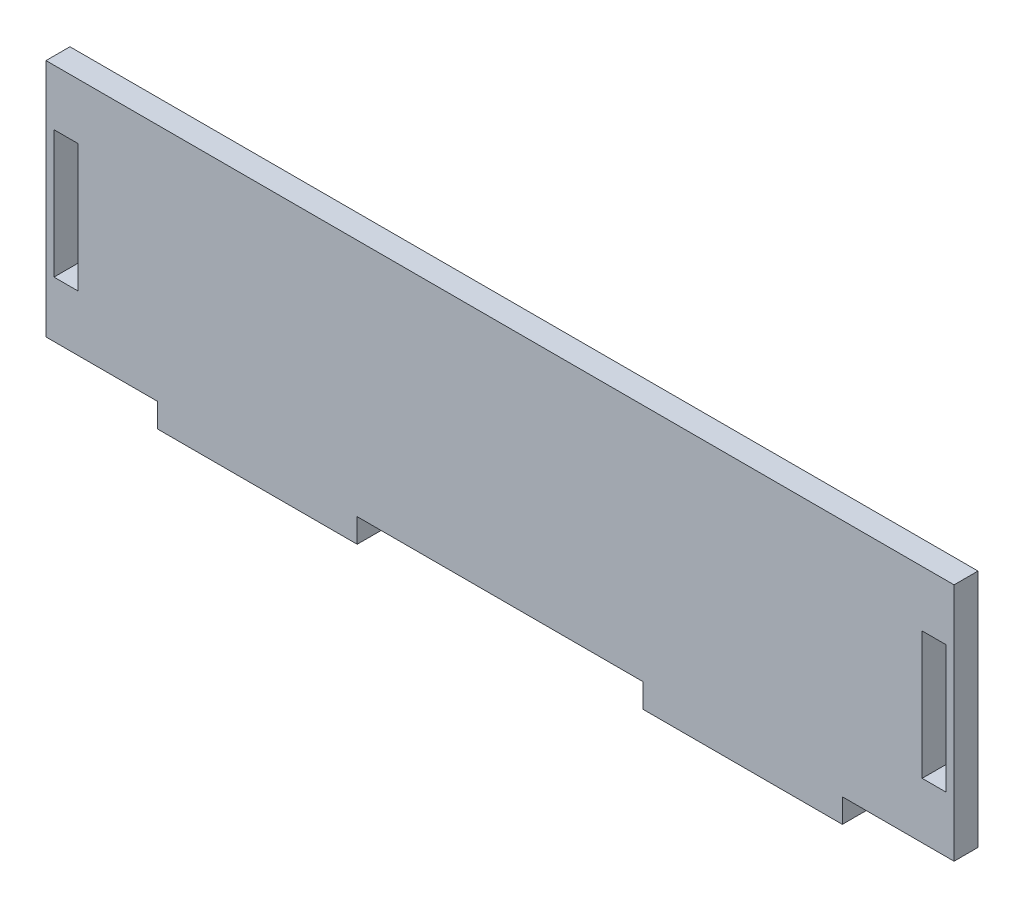
ISO-10303-21;
HEADER;
FILE_DESCRIPTION(('STEP AP214'),'2;1');
FILE_NAME('part.step','',(''),(''),'','','');
FILE_SCHEMA(('AUTOMOTIVE_DESIGN { 1 0 10303 214 1 1 1 1 }'));
ENDSEC;
DATA;
#1=APPLICATION_CONTEXT('core data for automotive mechanical design processes');
#2=APPLICATION_PROTOCOL_DEFINITION('international standard','automotive_design',2000,#1);
#3=PRODUCT_CONTEXT('',#1,'mechanical');
#4=PRODUCT('Part','Part','',(#3));
#5=PRODUCT_RELATED_PRODUCT_CATEGORY('part','',(#4));
#6=PRODUCT_DEFINITION_FORMATION('','',#4);
#7=PRODUCT_DEFINITION_CONTEXT('part definition',#1,'design');
#8=PRODUCT_DEFINITION('design','',#6,#7);
#9=PRODUCT_DEFINITION_SHAPE('','',#8);
#10=(LENGTH_UNIT() NAMED_UNIT(*) SI_UNIT(.MILLI.,.METRE.));
#11=(NAMED_UNIT(*) PLANE_ANGLE_UNIT() SI_UNIT($,.RADIAN.));
#12=(NAMED_UNIT(*) SI_UNIT($,.STERADIAN.) SOLID_ANGLE_UNIT());
#13=UNCERTAINTY_MEASURE_WITH_UNIT(LENGTH_MEASURE(1.E-05),#10,'distance_accuracy_value','');
#14=(GEOMETRIC_REPRESENTATION_CONTEXT(3) GLOBAL_UNCERTAINTY_ASSIGNED_CONTEXT((#13)) GLOBAL_UNIT_ASSIGNED_CONTEXT((#10,
#11,#12)) REPRESENTATION_CONTEXT('',''));
#15=CARTESIAN_POINT('',(0.,0.,0.));
#16=DIRECTION('',(0.,0.,1.));
#17=DIRECTION('',(1.,0.,0.));
#18=AXIS2_PLACEMENT_3D('',#15,#16,#17);
#19=CARTESIAN_POINT('',(0.,23.,3.));
#20=DIRECTION('',(0.,-1.,0.));
#21=DIRECTION('',(0.,0.,-1.));
#22=AXIS2_PLACEMENT_3D('',#19,#20,#21);
#23=PLANE('',#22);
#24=DIRECTION('',(-1.,0.,0.));
#25=VECTOR('',#24,1.);
#26=CARTESIAN_POINT('',(0.,23.,0.));
#27=LINE('',#26,#25);
#28=CARTESIAN_POINT('',(6.50000000000001,23.,0.));
#29=VERTEX_POINT('',#28);
#30=CARTESIAN_POINT('',(3.50000000000001,23.,0.));
#31=VERTEX_POINT('',#30);
#32=EDGE_CURVE('E253',#29,#31,#27,.T.);
#33=ORIENTED_EDGE('',*,*,#32,.F.);
#34=DIRECTION('',(0.,0.,-1.));
#35=VECTOR('',#34,1.);
#36=CARTESIAN_POINT('',(6.50000000000001,23.,3.));
#37=LINE('',#36,#35);
#38=CARTESIAN_POINT('',(6.50000000000001,23.,3.));
#39=VERTEX_POINT('',#38);
#40=EDGE_CURVE('E11',#39,#29,#37,.T.);
#41=ORIENTED_EDGE('',*,*,#40,.F.);
#42=DIRECTION('',(-1.,0.,0.));
#43=VECTOR('',#42,1.);
#44=CARTESIAN_POINT('',(0.,23.,3.));
#45=LINE('',#44,#43);
#46=CARTESIAN_POINT('',(3.50000000000001,23.,3.));
#47=VERTEX_POINT('',#46);
#48=EDGE_CURVE('E201',#39,#47,#45,.T.);
#49=ORIENTED_EDGE('',*,*,#48,.T.);
#50=DIRECTION('',(0.,0.,-1.));
#51=VECTOR('',#50,1.);
#52=CARTESIAN_POINT('',(3.50000000000001,23.,3.));
#53=LINE('',#52,#51);
#54=EDGE_CURVE('E127',#47,#31,#53,.T.);
#55=ORIENTED_EDGE('',*,*,#54,.T.);
#56=EDGE_LOOP('',(#33,#41,#49,#55));
#57=FACE_BOUND('',#56,.T.);
#58=ADVANCED_FACE('F37',(#57),#23,.T.);
#59=CARTESIAN_POINT('',(6.50000000000001,0.,3.));
#60=DIRECTION('',(-1.,0.,0.));
#61=DIRECTION('',(0.,0.,1.));
#62=AXIS2_PLACEMENT_3D('',#59,#60,#61);
#63=PLANE('',#62);
#64=DIRECTION('',(0.,1.,0.));
#65=VECTOR('',#64,1.);
#66=CARTESIAN_POINT('',(6.50000000000001,0.,0.));
#67=LINE('',#66,#65);
#68=CARTESIAN_POINT('',(6.50000000000001,7.,0.));
#69=VERTEX_POINT('',#68);
#70=EDGE_CURVE('E191',#69,#29,#67,.T.);
#71=ORIENTED_EDGE('',*,*,#70,.F.);
#72=DIRECTION('',(0.,0.,-1.));
#73=VECTOR('',#72,1.);
#74=CARTESIAN_POINT('',(6.50000000000001,7.,3.));
#75=LINE('',#74,#73);
#76=CARTESIAN_POINT('',(6.50000000000001,7.,3.));
#77=VERTEX_POINT('',#76);
#78=EDGE_CURVE('E47',#77,#69,#75,.T.);
#79=ORIENTED_EDGE('',*,*,#78,.F.);
#80=DIRECTION('',(0.,1.,0.));
#81=VECTOR('',#80,1.);
#82=CARTESIAN_POINT('',(6.50000000000001,0.,3.));
#83=LINE('',#82,#81);
#84=EDGE_CURVE('E189',#77,#39,#83,.T.);
#85=ORIENTED_EDGE('',*,*,#84,.T.);
#86=ORIENTED_EDGE('',*,*,#40,.T.);
#87=EDGE_LOOP('',(#71,#79,#85,#86));
#88=FACE_BOUND('',#87,.T.);
#89=ADVANCED_FACE('F187',(#88),#63,.T.);
#90=CARTESIAN_POINT('',(0.,7.,3.));
#91=DIRECTION('',(0.,-1.,0.));
#92=DIRECTION('',(0.,0.,-1.));
#93=AXIS2_PLACEMENT_3D('',#90,#91,#92);
#94=PLANE('',#93);
#95=DIRECTION('',(-1.,0.,0.));
#96=VECTOR('',#95,1.);
#97=CARTESIAN_POINT('',(0.,7.,0.));
#98=LINE('',#97,#96);
#99=CARTESIAN_POINT('',(3.50000000000001,7.,0.));
#100=VERTEX_POINT('',#99);
#101=EDGE_CURVE('E256',#69,#100,#98,.T.);
#102=ORIENTED_EDGE('',*,*,#101,.T.);
#103=DIRECTION('',(0.,0.,-1.));
#104=VECTOR('',#103,1.);
#105=CARTESIAN_POINT('',(3.50000000000001,7.,3.));
#106=LINE('',#105,#104);
#107=CARTESIAN_POINT('',(3.50000000000001,7.,3.));
#108=VERTEX_POINT('',#107);
#109=EDGE_CURVE('E194',#108,#100,#106,.T.);
#110=ORIENTED_EDGE('',*,*,#109,.F.);
#111=DIRECTION('',(-1.,0.,0.));
#112=VECTOR('',#111,1.);
#113=CARTESIAN_POINT('',(0.,7.,3.));
#114=LINE('',#113,#112);
#115=EDGE_CURVE('E197',#77,#108,#114,.T.);
#116=ORIENTED_EDGE('',*,*,#115,.F.);
#117=ORIENTED_EDGE('',*,*,#78,.T.);
#118=EDGE_LOOP('',(#102,#110,#116,#117));
#119=FACE_BOUND('',#118,.T.);
#120=ADVANCED_FACE('F198',(#119),#94,.F.);
#121=CARTESIAN_POINT('',(112.3,0.,3.));
#122=DIRECTION('',(-1.,0.,0.));
#123=DIRECTION('',(0.,0.,1.));
#124=AXIS2_PLACEMENT_3D('',#121,#122,#123);
#125=PLANE('',#124);
#126=DIRECTION('',(0.,1.,0.));
#127=VECTOR('',#126,1.);
#128=CARTESIAN_POINT('',(112.3,0.,0.));
#129=LINE('',#128,#127);
#130=CARTESIAN_POINT('',(112.3,7.,0.));
#131=VERTEX_POINT('',#130);
#132=CARTESIAN_POINT('',(112.3,23.,0.));
#133=VERTEX_POINT('',#132);
#134=EDGE_CURVE('E242',#131,#133,#129,.T.);
#135=ORIENTED_EDGE('',*,*,#134,.T.);
#136=DIRECTION('',(0.,0.,-1.));
#137=VECTOR('',#136,1.);
#138=CARTESIAN_POINT('',(112.3,23.,3.));
#139=LINE('',#138,#137);
#140=CARTESIAN_POINT('',(112.3,23.,3.));
#141=VERTEX_POINT('',#140);
#142=EDGE_CURVE('E261',#141,#133,#139,.T.);
#143=ORIENTED_EDGE('',*,*,#142,.F.);
#144=DIRECTION('',(0.,1.,0.));
#145=VECTOR('',#144,1.);
#146=CARTESIAN_POINT('',(112.3,0.,3.));
#147=LINE('',#146,#145);
#148=CARTESIAN_POINT('',(112.3,7.,3.));
#149=VERTEX_POINT('',#148);
#150=EDGE_CURVE('E376',#149,#141,#147,.T.);
#151=ORIENTED_EDGE('',*,*,#150,.F.);
#152=DIRECTION('',(0.,0.,-1.));
#153=VECTOR('',#152,1.);
#154=CARTESIAN_POINT('',(112.3,7.,3.));
#155=LINE('',#154,#153);
#156=EDGE_CURVE('E263',#149,#131,#155,.T.);
#157=ORIENTED_EDGE('',*,*,#156,.T.);
#158=EDGE_LOOP('',(#135,#143,#151,#157));
#159=FACE_BOUND('',#158,.T.);
#160=ADVANCED_FACE('F398',(#159),#125,.F.);
#161=CARTESIAN_POINT('',(0.,23.,3.));
#162=DIRECTION('',(0.,1.,0.));
#163=DIRECTION('',(0.,0.,1.));
#164=AXIS2_PLACEMENT_3D('',#161,#162,#163);
#165=PLANE('',#164);
#166=DIRECTION('',(1.,0.,0.));
#167=VECTOR('',#166,1.);
#168=CARTESIAN_POINT('',(0.,23.,0.));
#169=LINE('',#168,#167);
#170=CARTESIAN_POINT('',(115.3,23.,0.));
#171=VERTEX_POINT('',#170);
#172=EDGE_CURVE('E245',#133,#171,#169,.T.);
#173=ORIENTED_EDGE('',*,*,#172,.T.);
#174=DIRECTION('',(0.,0.,-1.));
#175=VECTOR('',#174,1.);
#176=CARTESIAN_POINT('',(115.3,23.,3.));
#177=LINE('',#176,#175);
#178=CARTESIAN_POINT('',(115.3,23.,3.));
#179=VERTEX_POINT('',#178);
#180=EDGE_CURVE('E267',#179,#171,#177,.T.);
#181=ORIENTED_EDGE('',*,*,#180,.F.);
#182=DIRECTION('',(1.,0.,0.));
#183=VECTOR('',#182,1.);
#184=CARTESIAN_POINT('',(0.,23.,3.));
#185=LINE('',#184,#183);
#186=EDGE_CURVE('E379',#141,#179,#185,.T.);
#187=ORIENTED_EDGE('',*,*,#186,.F.);
#188=ORIENTED_EDGE('',*,*,#142,.T.);
#189=EDGE_LOOP('',(#173,#181,#187,#188));
#190=FACE_BOUND('',#189,.T.);
#191=ADVANCED_FACE('F400',(#190),#165,.F.);
#192=CARTESIAN_POINT('',(115.3,0.,3.));
#193=DIRECTION('',(1.,0.,0.));
#194=DIRECTION('',(0.,0.,-1.));
#195=AXIS2_PLACEMENT_3D('',#192,#193,#194);
#196=PLANE('',#195);
#197=DIRECTION('',(0.,-1.,0.));
#198=VECTOR('',#197,1.);
#199=CARTESIAN_POINT('',(115.3,0.,0.));
#200=LINE('',#199,#198);
#201=CARTESIAN_POINT('',(115.3,7.,0.));
#202=VERTEX_POINT('',#201);
#203=EDGE_CURVE('E247',#171,#202,#200,.T.);
#204=ORIENTED_EDGE('',*,*,#203,.T.);
#205=DIRECTION('',(0.,0.,-1.));
#206=VECTOR('',#205,1.);
#207=CARTESIAN_POINT('',(115.3,7.,3.));
#208=LINE('',#207,#206);
#209=CARTESIAN_POINT('',(115.3,7.,3.));
#210=VERTEX_POINT('',#209);
#211=EDGE_CURVE('E265',#210,#202,#208,.T.);
#212=ORIENTED_EDGE('',*,*,#211,.F.);
#213=DIRECTION('',(0.,-1.,0.));
#214=VECTOR('',#213,1.);
#215=CARTESIAN_POINT('',(115.3,0.,3.));
#216=LINE('',#215,#214);
#217=EDGE_CURVE('E381',#179,#210,#216,.T.);
#218=ORIENTED_EDGE('',*,*,#217,.F.);
#219=ORIENTED_EDGE('',*,*,#180,.T.);
#220=EDGE_LOOP('',(#204,#212,#218,#219));
#221=FACE_BOUND('',#220,.T.);
#222=ADVANCED_FACE('F394',(#221),#196,.F.);
#223=CARTESIAN_POINT('',(0.,30.,3.));
#224=DIRECTION('',(0.,1.,0.));
#225=DIRECTION('',(0.,0.,1.));
#226=AXIS2_PLACEMENT_3D('',#223,#224,#225);
#227=PLANE('',#226);
#228=DIRECTION('',(1.,0.,0.));
#229=VECTOR('',#228,1.);
#230=CARTESIAN_POINT('',(0.,30.,0.));
#231=LINE('',#230,#229);
#232=CARTESIAN_POINT('',(2.50000000000001,30.,0.));
#233=VERTEX_POINT('',#232);
#234=CARTESIAN_POINT('',(116.3,30.,0.));
#235=VERTEX_POINT('',#234);
#236=EDGE_CURVE('E209',#233,#235,#231,.T.);
#237=ORIENTED_EDGE('',*,*,#236,.F.);
#238=DIRECTION('',(0.,0.,-1.));
#239=VECTOR('',#238,1.);
#240=CARTESIAN_POINT('',(2.50000000000001,30.,3.));
#241=LINE('',#240,#239);
#242=CARTESIAN_POINT('',(2.50000000000001,30.,3.));
#243=VERTEX_POINT('',#242);
#244=EDGE_CURVE('E41',#243,#233,#241,.T.);
#245=ORIENTED_EDGE('',*,*,#244,.F.);
#246=DIRECTION('',(1.,0.,0.));
#247=VECTOR('',#246,1.);
#248=CARTESIAN_POINT('',(0.,30.,3.));
#249=LINE('',#248,#247);
#250=CARTESIAN_POINT('',(116.3,30.,3.));
#251=VERTEX_POINT('',#250);
#252=EDGE_CURVE('E259',#243,#251,#249,.T.);
#253=ORIENTED_EDGE('',*,*,#252,.T.);
#254=DIRECTION('',(0.,0.,-1.));
#255=VECTOR('',#254,1.);
#256=CARTESIAN_POINT('',(116.3,30.,3.));
#257=LINE('',#256,#255);
#258=EDGE_CURVE('E208',#251,#235,#257,.T.);
#259=ORIENTED_EDGE('',*,*,#258,.T.);
#260=EDGE_LOOP('',(#237,#245,#253,#259));
#261=FACE_BOUND('',#260,.T.);
#262=ADVANCED_FACE('F39',(#261),#227,.T.);
#263=CARTESIAN_POINT('',(2.50000000000001,0.,3.));
#264=DIRECTION('',(1.,0.,0.));
#265=DIRECTION('',(0.,0.,-1.));
#266=AXIS2_PLACEMENT_3D('',#263,#264,#265);
#267=PLANE('',#266);
#268=DIRECTION('',(0.,-1.,0.));
#269=VECTOR('',#268,1.);
#270=CARTESIAN_POINT('',(2.50000000000001,0.,0.));
#271=LINE('',#270,#269);
#272=CARTESIAN_POINT('',(2.50000000000001,0.,0.));
#273=VERTEX_POINT('',#272);
#274=EDGE_CURVE('E212',#233,#273,#271,.T.);
#275=ORIENTED_EDGE('',*,*,#274,.T.);
#276=DIRECTION('',(0.,0.,-1.));
#277=VECTOR('',#276,1.);
#278=CARTESIAN_POINT('',(2.50000000000001,0.,3.));
#279=LINE('',#278,#277);
#280=CARTESIAN_POINT('',(2.50000000000001,0.,3.));
#281=VERTEX_POINT('',#280);
#282=EDGE_CURVE('E292',#281,#273,#279,.T.);
#283=ORIENTED_EDGE('',*,*,#282,.F.);
#284=DIRECTION('',(0.,-1.,0.));
#285=VECTOR('',#284,1.);
#286=CARTESIAN_POINT('',(2.50000000000001,0.,3.));
#287=LINE('',#286,#285);
#288=EDGE_CURVE('E301',#243,#281,#287,.T.);
#289=ORIENTED_EDGE('',*,*,#288,.F.);
#290=ORIENTED_EDGE('',*,*,#244,.T.);
#291=EDGE_LOOP('',(#275,#283,#289,#290));
#292=FACE_BOUND('',#291,.T.);
#293=ADVANCED_FACE('F300',(#292),#267,.F.);
#294=CARTESIAN_POINT('',(0.,0.,3.));
#295=DIRECTION('',(0.,1.,0.));
#296=DIRECTION('',(0.,0.,1.));
#297=AXIS2_PLACEMENT_3D('',#294,#295,#296);
#298=PLANE('',#297);
#299=DIRECTION('',(1.,0.,0.));
#300=VECTOR('',#299,1.);
#301=CARTESIAN_POINT('',(0.,0.,0.));
#302=LINE('',#301,#300);
#303=CARTESIAN_POINT('',(16.5,0.,0.));
#304=VERTEX_POINT('',#303);
#305=EDGE_CURVE('E214',#273,#304,#302,.T.);
#306=ORIENTED_EDGE('',*,*,#305,.T.);
#307=DIRECTION('',(0.,0.,-1.));
#308=VECTOR('',#307,1.);
#309=CARTESIAN_POINT('',(16.5,0.,3.));
#310=LINE('',#309,#308);
#311=CARTESIAN_POINT('',(16.5,0.,3.));
#312=VERTEX_POINT('',#311);
#313=EDGE_CURVE('E290',#312,#304,#310,.T.);
#314=ORIENTED_EDGE('',*,*,#313,.F.);
#315=DIRECTION('',(1.,0.,0.));
#316=VECTOR('',#315,1.);
#317=CARTESIAN_POINT('',(0.,0.,3.));
#318=LINE('',#317,#316);
#319=EDGE_CURVE('E358',#281,#312,#318,.T.);
#320=ORIENTED_EDGE('',*,*,#319,.F.);
#321=ORIENTED_EDGE('',*,*,#282,.T.);
#322=EDGE_LOOP('',(#306,#314,#320,#321));
#323=FACE_BOUND('',#322,.T.);
#324=ADVANCED_FACE('F357',(#323),#298,.F.);
#325=CARTESIAN_POINT('',(16.5,0.,3.));
#326=DIRECTION('',(1.,0.,0.));
#327=DIRECTION('',(0.,0.,-1.));
#328=AXIS2_PLACEMENT_3D('',#325,#326,#327);
#329=PLANE('',#328);
#330=DIRECTION('',(0.,-1.,0.));
#331=VECTOR('',#330,1.);
#332=CARTESIAN_POINT('',(16.5,0.,0.));
#333=LINE('',#332,#331);
#334=CARTESIAN_POINT('',(16.5,-3.,0.));
#335=VERTEX_POINT('',#334);
#336=EDGE_CURVE('E216',#304,#335,#333,.T.);
#337=ORIENTED_EDGE('',*,*,#336,.T.);
#338=DIRECTION('',(0.,0.,-1.));
#339=VECTOR('',#338,1.);
#340=CARTESIAN_POINT('',(16.5,-3.,3.));
#341=LINE('',#340,#339);
#342=CARTESIAN_POINT('',(16.5,-3.,3.));
#343=VERTEX_POINT('',#342);
#344=EDGE_CURVE('E288',#343,#335,#341,.T.);
#345=ORIENTED_EDGE('',*,*,#344,.F.);
#346=DIRECTION('',(0.,-1.,0.));
#347=VECTOR('',#346,1.);
#348=CARTESIAN_POINT('',(16.5,0.,3.));
#349=LINE('',#348,#347);
#350=EDGE_CURVE('E356',#312,#343,#349,.T.);
#351=ORIENTED_EDGE('',*,*,#350,.F.);
#352=ORIENTED_EDGE('',*,*,#313,.T.);
#353=EDGE_LOOP('',(#337,#345,#351,#352));
#354=FACE_BOUND('',#353,.T.);
#355=ADVANCED_FACE('F354',(#354),#329,.F.);
#356=CARTESIAN_POINT('',(0.,-3.,3.));
#357=DIRECTION('',(0.,-1.,0.));
#358=DIRECTION('',(0.,0.,-1.));
#359=AXIS2_PLACEMENT_3D('',#356,#357,#358);
#360=PLANE('',#359);
#361=DIRECTION('',(-1.,0.,0.));
#362=VECTOR('',#361,1.);
#363=CARTESIAN_POINT('',(0.,-3.,0.));
#364=LINE('',#363,#362);
#365=CARTESIAN_POINT('',(41.5,-3.,0.));
#366=VERTEX_POINT('',#365);
#367=EDGE_CURVE('E219',#366,#335,#364,.T.);
#368=ORIENTED_EDGE('',*,*,#367,.F.);
#369=DIRECTION('',(0.,0.,-1.));
#370=VECTOR('',#369,1.);
#371=CARTESIAN_POINT('',(41.5,-3.,3.));
#372=LINE('',#371,#370);
#373=CARTESIAN_POINT('',(41.5,-3.,3.));
#374=VERTEX_POINT('',#373);
#375=EDGE_CURVE('E286',#374,#366,#372,.T.);
#376=ORIENTED_EDGE('',*,*,#375,.F.);
#377=DIRECTION('',(-1.,0.,0.));
#378=VECTOR('',#377,1.);
#379=CARTESIAN_POINT('',(0.,-3.,3.));
#380=LINE('',#379,#378);
#381=EDGE_CURVE('E351',#374,#343,#380,.T.);
#382=ORIENTED_EDGE('',*,*,#381,.T.);
#383=ORIENTED_EDGE('',*,*,#344,.T.);
#384=EDGE_LOOP('',(#368,#376,#382,#383));
#385=FACE_BOUND('',#384,.T.);
#386=ADVANCED_FACE('F347',(#385),#360,.T.);
#387=CARTESIAN_POINT('',(41.5,0.,3.));
#388=DIRECTION('',(1.,0.,0.));
#389=DIRECTION('',(0.,0.,-1.));
#390=AXIS2_PLACEMENT_3D('',#387,#388,#389);
#391=PLANE('',#390);
#392=DIRECTION('',(0.,-1.,0.));
#393=VECTOR('',#392,1.);
#394=CARTESIAN_POINT('',(41.5,0.,0.));
#395=LINE('',#394,#393);
#396=CARTESIAN_POINT('',(41.5,0.,0.));
#397=VERTEX_POINT('',#396);
#398=EDGE_CURVE('E222',#397,#366,#395,.T.);
#399=ORIENTED_EDGE('',*,*,#398,.F.);
#400=DIRECTION('',(0.,0.,-1.));
#401=VECTOR('',#400,1.);
#402=CARTESIAN_POINT('',(41.5,0.,3.));
#403=LINE('',#402,#401);
#404=CARTESIAN_POINT('',(41.5,0.,3.));
#405=VERTEX_POINT('',#404);
#406=EDGE_CURVE('E284',#405,#397,#403,.T.);
#407=ORIENTED_EDGE('',*,*,#406,.F.);
#408=DIRECTION('',(0.,-1.,0.));
#409=VECTOR('',#408,1.);
#410=CARTESIAN_POINT('',(41.5,0.,3.));
#411=LINE('',#410,#409);
#412=EDGE_CURVE('E366',#405,#374,#411,.T.);
#413=ORIENTED_EDGE('',*,*,#412,.T.);
#414=ORIENTED_EDGE('',*,*,#375,.T.);
#415=EDGE_LOOP('',(#399,#407,#413,#414));
#416=FACE_BOUND('',#415,.T.);
#417=ADVANCED_FACE('F344',(#416),#391,.T.);
#418=CARTESIAN_POINT('',(0.,0.,3.));
#419=DIRECTION('',(0.,-1.,0.));
#420=DIRECTION('',(0.,0.,-1.));
#421=AXIS2_PLACEMENT_3D('',#418,#419,#420);
#422=PLANE('',#421);
#423=DIRECTION('',(-1.,0.,0.));
#424=VECTOR('',#423,1.);
#425=CARTESIAN_POINT('',(0.,0.,0.));
#426=LINE('',#425,#424);
#427=CARTESIAN_POINT('',(77.3,0.,0.));
#428=VERTEX_POINT('',#427);
#429=EDGE_CURVE('E225',#428,#397,#426,.T.);
#430=ORIENTED_EDGE('',*,*,#429,.F.);
#431=DIRECTION('',(0.,0.,-1.));
#432=VECTOR('',#431,1.);
#433=CARTESIAN_POINT('',(77.3,0.,3.));
#434=LINE('',#433,#432);
#435=CARTESIAN_POINT('',(77.3,0.,3.));
#436=VERTEX_POINT('',#435);
#437=EDGE_CURVE('E282',#436,#428,#434,.T.);
#438=ORIENTED_EDGE('',*,*,#437,.F.);
#439=DIRECTION('',(-1.,0.,0.));
#440=VECTOR('',#439,1.);
#441=CARTESIAN_POINT('',(0.,0.,3.));
#442=LINE('',#441,#440);
#443=EDGE_CURVE('E340',#436,#405,#442,.T.);
#444=ORIENTED_EDGE('',*,*,#443,.T.);
#445=ORIENTED_EDGE('',*,*,#406,.T.);
#446=EDGE_LOOP('',(#430,#438,#444,#445));
#447=FACE_BOUND('',#446,.T.);
#448=ADVANCED_FACE('F335',(#447),#422,.T.);
#449=CARTESIAN_POINT('',(77.3,0.,3.));
#450=DIRECTION('',(1.,0.,0.));
#451=DIRECTION('',(0.,0.,-1.));
#452=AXIS2_PLACEMENT_3D('',#449,#450,#451);
#453=PLANE('',#452);
#454=DIRECTION('',(0.,-1.,0.));
#455=VECTOR('',#454,1.);
#456=CARTESIAN_POINT('',(77.3,0.,0.));
#457=LINE('',#456,#455);
#458=CARTESIAN_POINT('',(77.3,-3.,0.));
#459=VERTEX_POINT('',#458);
#460=EDGE_CURVE('E228',#428,#459,#457,.T.);
#461=ORIENTED_EDGE('',*,*,#460,.T.);
#462=DIRECTION('',(0.,0.,-1.));
#463=VECTOR('',#462,1.);
#464=CARTESIAN_POINT('',(77.3,-3.,3.));
#465=LINE('',#464,#463);
#466=CARTESIAN_POINT('',(77.3,-3.,3.));
#467=VERTEX_POINT('',#466);
#468=EDGE_CURVE('E279',#467,#459,#465,.T.);
#469=ORIENTED_EDGE('',*,*,#468,.F.);
#470=DIRECTION('',(0.,-1.,0.));
#471=VECTOR('',#470,1.);
#472=CARTESIAN_POINT('',(77.3,0.,3.));
#473=LINE('',#472,#471);
#474=EDGE_CURVE('E369',#436,#467,#473,.T.);
#475=ORIENTED_EDGE('',*,*,#474,.F.);
#476=ORIENTED_EDGE('',*,*,#437,.T.);
#477=EDGE_LOOP('',(#461,#469,#475,#476));
#478=FACE_BOUND('',#477,.T.);
#479=ADVANCED_FACE('F432',(#478),#453,.F.);
#480=CARTESIAN_POINT('',(0.,-3.,3.));
#481=DIRECTION('',(0.,1.,0.));
#482=DIRECTION('',(0.,0.,1.));
#483=AXIS2_PLACEMENT_3D('',#480,#481,#482);
#484=PLANE('',#483);
#485=DIRECTION('',(1.,0.,0.));
#486=VECTOR('',#485,1.);
#487=CARTESIAN_POINT('',(0.,-3.,0.));
#488=LINE('',#487,#486);
#489=CARTESIAN_POINT('',(102.3,-3.,0.));
#490=VERTEX_POINT('',#489);
#491=EDGE_CURVE('E230',#459,#490,#488,.T.);
#492=ORIENTED_EDGE('',*,*,#491,.T.);
#493=DIRECTION('',(0.,0.,-1.));
#494=VECTOR('',#493,1.);
#495=CARTESIAN_POINT('',(102.3,-3.,3.));
#496=LINE('',#495,#494);
#497=CARTESIAN_POINT('',(102.3,-3.,3.));
#498=VERTEX_POINT('',#497);
#499=EDGE_CURVE('E277',#498,#490,#496,.T.);
#500=ORIENTED_EDGE('',*,*,#499,.F.);
#501=DIRECTION('',(1.,0.,0.));
#502=VECTOR('',#501,1.);
#503=CARTESIAN_POINT('',(0.,-3.,3.));
#504=LINE('',#503,#502);
#505=EDGE_CURVE('E371',#467,#498,#504,.T.);
#506=ORIENTED_EDGE('',*,*,#505,.F.);
#507=ORIENTED_EDGE('',*,*,#468,.T.);
#508=EDGE_LOOP('',(#492,#500,#506,#507));
#509=FACE_BOUND('',#508,.T.);
#510=ADVANCED_FACE('F329',(#509),#484,.F.);
#511=CARTESIAN_POINT('',(102.3,0.,3.));
#512=DIRECTION('',(1.,0.,0.));
#513=DIRECTION('',(0.,0.,-1.));
#514=AXIS2_PLACEMENT_3D('',#511,#512,#513);
#515=PLANE('',#514);
#516=DIRECTION('',(0.,-1.,0.));
#517=VECTOR('',#516,1.);
#518=CARTESIAN_POINT('',(102.3,0.,0.));
#519=LINE('',#518,#517);
#520=CARTESIAN_POINT('',(102.3,0.,0.));
#521=VERTEX_POINT('',#520);
#522=EDGE_CURVE('E233',#521,#490,#519,.T.);
#523=ORIENTED_EDGE('',*,*,#522,.F.);
#524=DIRECTION('',(0.,0.,-1.));
#525=VECTOR('',#524,1.);
#526=CARTESIAN_POINT('',(102.3,0.,3.));
#527=LINE('',#526,#525);
#528=CARTESIAN_POINT('',(102.3,0.,3.));
#529=VERTEX_POINT('',#528);
#530=EDGE_CURVE('E275',#529,#521,#527,.T.);
#531=ORIENTED_EDGE('',*,*,#530,.F.);
#532=DIRECTION('',(0.,-1.,0.));
#533=VECTOR('',#532,1.);
#534=CARTESIAN_POINT('',(102.3,0.,3.));
#535=LINE('',#534,#533);
#536=EDGE_CURVE('E326',#529,#498,#535,.T.);
#537=ORIENTED_EDGE('',*,*,#536,.T.);
#538=ORIENTED_EDGE('',*,*,#499,.T.);
#539=EDGE_LOOP('',(#523,#531,#537,#538));
#540=FACE_BOUND('',#539,.T.);
#541=ADVANCED_FACE('F324',(#540),#515,.T.);
#542=CARTESIAN_POINT('',(0.,0.,3.));
#543=DIRECTION('',(0.,-1.,0.));
#544=DIRECTION('',(0.,0.,-1.));
#545=AXIS2_PLACEMENT_3D('',#542,#543,#544);
#546=PLANE('',#545);
#547=DIRECTION('',(-1.,0.,0.));
#548=VECTOR('',#547,1.);
#549=CARTESIAN_POINT('',(0.,0.,0.));
#550=LINE('',#549,#548);
#551=CARTESIAN_POINT('',(116.3,0.,0.));
#552=VERTEX_POINT('',#551);
#553=EDGE_CURVE('E236',#552,#521,#550,.T.);
#554=ORIENTED_EDGE('',*,*,#553,.F.);
#555=DIRECTION('',(0.,0.,-1.));
#556=VECTOR('',#555,1.);
#557=CARTESIAN_POINT('',(116.3,0.,3.));
#558=LINE('',#557,#556);
#559=CARTESIAN_POINT('',(116.3,0.,3.));
#560=VERTEX_POINT('',#559);
#561=EDGE_CURVE('E273',#560,#552,#558,.T.);
#562=ORIENTED_EDGE('',*,*,#561,.F.);
#563=DIRECTION('',(-1.,0.,0.));
#564=VECTOR('',#563,1.);
#565=CARTESIAN_POINT('',(0.,0.,3.));
#566=LINE('',#565,#564);
#567=EDGE_CURVE('E320',#560,#529,#566,.T.);
#568=ORIENTED_EDGE('',*,*,#567,.T.);
#569=ORIENTED_EDGE('',*,*,#530,.T.);
#570=EDGE_LOOP('',(#554,#562,#568,#569));
#571=FACE_BOUND('',#570,.T.);
#572=ADVANCED_FACE('F317',(#571),#546,.T.);
#573=CARTESIAN_POINT('',(0.,7.,3.));
#574=DIRECTION('',(0.,1.,0.));
#575=DIRECTION('',(0.,0.,1.));
#576=AXIS2_PLACEMENT_3D('',#573,#574,#575);
#577=PLANE('',#576);
#578=DIRECTION('',(1.,0.,0.));
#579=VECTOR('',#578,1.);
#580=CARTESIAN_POINT('',(0.,7.,0.));
#581=LINE('',#580,#579);
#582=EDGE_CURVE('E250',#131,#202,#581,.T.);
#583=ORIENTED_EDGE('',*,*,#582,.F.);
#584=ORIENTED_EDGE('',*,*,#156,.F.);
#585=DIRECTION('',(1.,0.,0.));
#586=VECTOR('',#585,1.);
#587=CARTESIAN_POINT('',(0.,7.,3.));
#588=LINE('',#587,#586);
#589=EDGE_CURVE('E203',#149,#210,#588,.T.);
#590=ORIENTED_EDGE('',*,*,#589,.T.);
#591=ORIENTED_EDGE('',*,*,#211,.T.);
#592=EDGE_LOOP('',(#583,#584,#590,#591));
#593=FACE_BOUND('',#592,.T.);
#594=ADVANCED_FACE('F386',(#593),#577,.T.);
#595=CARTESIAN_POINT('',(116.3,0.,3.));
#596=DIRECTION('',(1.,0.,0.));
#597=DIRECTION('',(0.,0.,-1.));
#598=AXIS2_PLACEMENT_3D('',#595,#596,#597);
#599=PLANE('',#598);
#600=DIRECTION('',(0.,-1.,0.));
#601=VECTOR('',#600,1.);
#602=CARTESIAN_POINT('',(116.3,0.,0.));
#603=LINE('',#602,#601);
#604=EDGE_CURVE('E239',#235,#552,#603,.T.);
#605=ORIENTED_EDGE('',*,*,#604,.F.);
#606=ORIENTED_EDGE('',*,*,#258,.F.);
#607=DIRECTION('',(0.,-1.,0.));
#608=VECTOR('',#607,1.);
#609=CARTESIAN_POINT('',(116.3,0.,3.));
#610=LINE('',#609,#608);
#611=EDGE_CURVE('E312',#251,#560,#610,.T.);
#612=ORIENTED_EDGE('',*,*,#611,.T.);
#613=ORIENTED_EDGE('',*,*,#561,.T.);
#614=EDGE_LOOP('',(#605,#606,#612,#613));
#615=FACE_BOUND('',#614,.T.);
#616=ADVANCED_FACE('F311',(#615),#599,.T.);
#617=CARTESIAN_POINT('',(3.50000000000001,0.,3.));
#618=DIRECTION('',(-1.,0.,0.));
#619=DIRECTION('',(0.,0.,1.));
#620=AXIS2_PLACEMENT_3D('',#617,#618,#619);
#621=PLANE('',#620);
#622=DIRECTION('',(0.,1.,0.));
#623=VECTOR('',#622,1.);
#624=CARTESIAN_POINT('',(3.50000000000001,0.,0.));
#625=LINE('',#624,#623);
#626=EDGE_CURVE('E120',#100,#31,#625,.T.);
#627=ORIENTED_EDGE('',*,*,#626,.T.);
#628=ORIENTED_EDGE('',*,*,#54,.F.);
#629=DIRECTION('',(0.,1.,0.));
#630=VECTOR('',#629,1.);
#631=CARTESIAN_POINT('',(3.50000000000001,0.,3.));
#632=LINE('',#631,#630);
#633=EDGE_CURVE('E56',#108,#47,#632,.T.);
#634=ORIENTED_EDGE('',*,*,#633,.F.);
#635=ORIENTED_EDGE('',*,*,#109,.T.);
#636=EDGE_LOOP('',(#627,#628,#634,#635));
#637=FACE_BOUND('',#636,.T.);
#638=ADVANCED_FACE('F422',(#637),#621,.F.);
#639=CARTESIAN_POINT('',(0.,0.,3.));
#640=DIRECTION('',(0.,0.,1.));
#641=DIRECTION('',(1.,0.,0.));
#642=AXIS2_PLACEMENT_3D('',#639,#640,#641);
#643=PLANE('',#642);
#644=ORIENTED_EDGE('',*,*,#252,.F.);
#645=ORIENTED_EDGE('',*,*,#288,.T.);
#646=ORIENTED_EDGE('',*,*,#319,.T.);
#647=ORIENTED_EDGE('',*,*,#350,.T.);
#648=ORIENTED_EDGE('',*,*,#381,.F.);
#649=ORIENTED_EDGE('',*,*,#412,.F.);
#650=ORIENTED_EDGE('',*,*,#443,.F.);
#651=ORIENTED_EDGE('',*,*,#474,.T.);
#652=ORIENTED_EDGE('',*,*,#505,.T.);
#653=ORIENTED_EDGE('',*,*,#536,.F.);
#654=ORIENTED_EDGE('',*,*,#567,.F.);
#655=ORIENTED_EDGE('',*,*,#611,.F.);
#656=EDGE_LOOP('',(#644,#645,#646,#647,#648,#649,#650,#651,#652,#653,#654,#655));
#657=FACE_BOUND('',#656,.T.);
#658=ORIENTED_EDGE('',*,*,#150,.T.);
#659=ORIENTED_EDGE('',*,*,#186,.T.);
#660=ORIENTED_EDGE('',*,*,#217,.T.);
#661=ORIENTED_EDGE('',*,*,#589,.F.);
#662=EDGE_LOOP('',(#658,#659,#660,#661));
#663=FACE_BOUND('',#662,.T.);
#664=ORIENTED_EDGE('',*,*,#48,.F.);
#665=ORIENTED_EDGE('',*,*,#84,.F.);
#666=ORIENTED_EDGE('',*,*,#115,.T.);
#667=ORIENTED_EDGE('',*,*,#633,.T.);
#668=EDGE_LOOP('',(#664,#665,#666,#667));
#669=FACE_BOUND('',#668,.T.);
#670=ADVANCED_FACE('F200',(#657,#663,#669),#643,.T.);
#671=CARTESIAN_POINT('',(0.,0.,0.));
#672=DIRECTION('',(0.,0.,1.));
#673=DIRECTION('',(1.,0.,0.));
#674=AXIS2_PLACEMENT_3D('',#671,#672,#673);
#675=PLANE('',#674);
#676=ORIENTED_EDGE('',*,*,#236,.T.);
#677=ORIENTED_EDGE('',*,*,#604,.T.);
#678=ORIENTED_EDGE('',*,*,#553,.T.);
#679=ORIENTED_EDGE('',*,*,#522,.T.);
#680=ORIENTED_EDGE('',*,*,#491,.F.);
#681=ORIENTED_EDGE('',*,*,#460,.F.);
#682=ORIENTED_EDGE('',*,*,#429,.T.);
#683=ORIENTED_EDGE('',*,*,#398,.T.);
#684=ORIENTED_EDGE('',*,*,#367,.T.);
#685=ORIENTED_EDGE('',*,*,#336,.F.);
#686=ORIENTED_EDGE('',*,*,#305,.F.);
#687=ORIENTED_EDGE('',*,*,#274,.F.);
#688=EDGE_LOOP('',(#676,#677,#678,#679,#680,#681,#682,#683,#684,#685,#686,#687));
#689=FACE_BOUND('',#688,.T.);
#690=ORIENTED_EDGE('',*,*,#134,.F.);
#691=ORIENTED_EDGE('',*,*,#582,.T.);
#692=ORIENTED_EDGE('',*,*,#203,.F.);
#693=ORIENTED_EDGE('',*,*,#172,.F.);
#694=EDGE_LOOP('',(#690,#691,#692,#693));
#695=FACE_BOUND('',#694,.T.);
#696=ORIENTED_EDGE('',*,*,#32,.T.);
#697=ORIENTED_EDGE('',*,*,#626,.F.);
#698=ORIENTED_EDGE('',*,*,#101,.F.);
#699=ORIENTED_EDGE('',*,*,#70,.T.);
#700=EDGE_LOOP('',(#696,#697,#698,#699));
#701=FACE_BOUND('',#700,.T.);
#702=ADVANCED_FACE('F304',(#689,#695,#701),#675,.F.);
#703=CLOSED_SHELL('',(#58,#89,#120,#160,#191,#222,#262,#293,#324,#355,#386,#417,#448,#479,#510,
#541,#572,#594,#616,#638,#670,#702));
#704=MANIFOLD_SOLID_BREP('B2',#703);
#705=ADVANCED_BREP_SHAPE_REPRESENTATION('',(#18,#704),#14);
#706=SHAPE_DEFINITION_REPRESENTATION(#9,#705);
ENDSEC;
END-ISO-10303-21;
